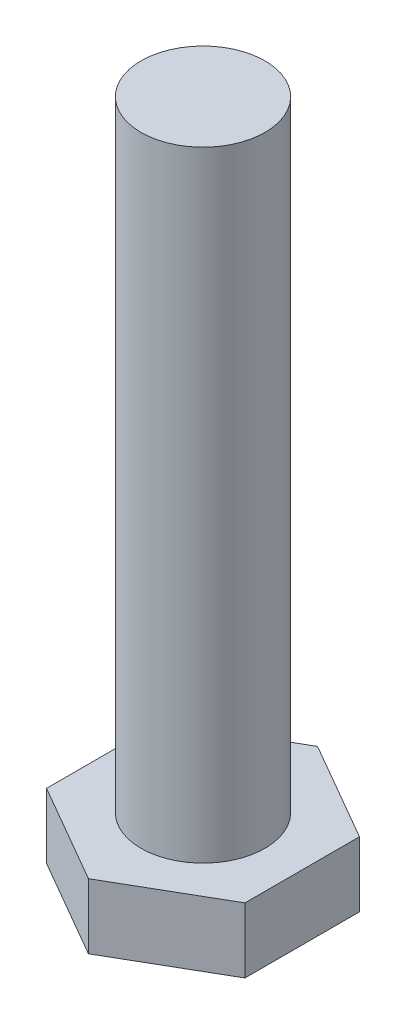
ISO-10303-21;
HEADER;
FILE_DESCRIPTION(('STEP AP214'),'2;1');
FILE_NAME('part.step','',(''),(''),'','','');
FILE_SCHEMA(('AUTOMOTIVE_DESIGN { 1 0 10303 214 1 1 1 1 }'));
ENDSEC;
DATA;
#1=APPLICATION_CONTEXT('core data for automotive mechanical design processes');
#2=APPLICATION_PROTOCOL_DEFINITION('international standard','automotive_design',2000,#1);
#3=PRODUCT_CONTEXT('',#1,'mechanical');
#4=PRODUCT('Part','Part','',(#3));
#5=PRODUCT_RELATED_PRODUCT_CATEGORY('part','',(#4));
#6=PRODUCT_DEFINITION_FORMATION('','',#4);
#7=PRODUCT_DEFINITION_CONTEXT('part definition',#1,'design');
#8=PRODUCT_DEFINITION('design','',#6,#7);
#9=PRODUCT_DEFINITION_SHAPE('','',#8);
#10=(LENGTH_UNIT() NAMED_UNIT(*) SI_UNIT(.MILLI.,.METRE.));
#11=(NAMED_UNIT(*) PLANE_ANGLE_UNIT() SI_UNIT($,.RADIAN.));
#12=(NAMED_UNIT(*) SI_UNIT($,.STERADIAN.) SOLID_ANGLE_UNIT());
#13=UNCERTAINTY_MEASURE_WITH_UNIT(LENGTH_MEASURE(1.E-05),#10,'distance_accuracy_value','');
#14=(GEOMETRIC_REPRESENTATION_CONTEXT(3) GLOBAL_UNCERTAINTY_ASSIGNED_CONTEXT((#13)) GLOBAL_UNIT_ASSIGNED_CONTEXT((#10,
#11,#12)) REPRESENTATION_CONTEXT('',''));
#15=CARTESIAN_POINT('',(0.,0.,0.));
#16=DIRECTION('',(0.,0.,1.));
#17=DIRECTION('',(1.,0.,0.));
#18=AXIS2_PLACEMENT_3D('',#15,#16,#17);
#19=CARTESIAN_POINT('',(0.,3.2,0.));
#20=DIRECTION('',(0.,1.,0.));
#21=DIRECTION('',(0.,0.,1.));
#22=AXIS2_PLACEMENT_3D('',#19,#20,#21);
#23=PLANE('',#22);
#24=DIRECTION('',(0.866025403784439,0.,-0.5));
#25=VECTOR('',#24,1.);
#26=CARTESIAN_POINT('',(0.,3.2,4.61880215351701));
#27=LINE('',#26,#25);
#28=CARTESIAN_POINT('',(0.,3.2,4.61880215351701));
#29=VERTEX_POINT('',#28);
#30=CARTESIAN_POINT('',(4.,3.2,2.3094010767585));
#31=VERTEX_POINT('',#30);
#32=EDGE_CURVE('E118',#29,#31,#27,.T.);
#33=ORIENTED_EDGE('',*,*,#32,.T.);
#34=DIRECTION('',(0.,0.,-1.));
#35=VECTOR('',#34,1.);
#36=CARTESIAN_POINT('',(4.,3.2,2.3094010767585));
#37=LINE('',#36,#35);
#38=CARTESIAN_POINT('',(4.,3.2,-2.3094010767585));
#39=VERTEX_POINT('',#38);
#40=EDGE_CURVE('E107',#31,#39,#37,.T.);
#41=ORIENTED_EDGE('',*,*,#40,.T.);
#42=DIRECTION('',(-0.866025403784439,0.,-0.5));
#43=VECTOR('',#42,1.);
#44=CARTESIAN_POINT('',(4.,3.2,-2.3094010767585));
#45=LINE('',#44,#43);
#46=CARTESIAN_POINT('',(0.,3.2,-4.61880215351701));
#47=VERTEX_POINT('',#46);
#48=EDGE_CURVE('E117',#39,#47,#45,.T.);
#49=ORIENTED_EDGE('',*,*,#48,.T.);
#50=DIRECTION('',(-0.866025403784438,0.,0.5));
#51=VECTOR('',#50,1.);
#52=CARTESIAN_POINT('',(0.,3.2,-4.61880215351701));
#53=LINE('',#52,#51);
#54=CARTESIAN_POINT('',(-4.,3.2,-2.3094010767585));
#55=VERTEX_POINT('',#54);
#56=EDGE_CURVE('E186',#47,#55,#53,.T.);
#57=ORIENTED_EDGE('',*,*,#56,.T.);
#58=DIRECTION('',(0.,0.,1.));
#59=VECTOR('',#58,1.);
#60=CARTESIAN_POINT('',(-4.,3.2,-2.3094010767585));
#61=LINE('',#60,#59);
#62=CARTESIAN_POINT('',(-4.,3.2,2.3094010767585));
#63=VERTEX_POINT('',#62);
#64=EDGE_CURVE('E188',#55,#63,#61,.T.);
#65=ORIENTED_EDGE('',*,*,#64,.T.);
#66=DIRECTION('',(0.866025403784439,0.,0.5));
#67=VECTOR('',#66,1.);
#68=CARTESIAN_POINT('',(-4.,3.2,2.3094010767585));
#69=LINE('',#68,#67);
#70=EDGE_CURVE('E123',#63,#29,#69,.T.);
#71=ORIENTED_EDGE('',*,*,#70,.T.);
#72=EDGE_LOOP('',(#33,#41,#49,#57,#65,#71));
#73=FACE_BOUND('',#72,.T.);
#74=CARTESIAN_POINT('',(0.,3.2,0.));
#75=DIRECTION('',(0.,1.,0.));
#76=DIRECTION('',(0.,0.,1.));
#77=AXIS2_PLACEMENT_3D('',#74,#75,#76);
#78=CIRCLE('',#77,2.5);
#79=CARTESIAN_POINT('',(0.,3.2,2.5));
#80=VERTEX_POINT('',#79);
#81=EDGE_CURVE('E174',#80,#80,#78,.T.);
#82=ORIENTED_EDGE('',*,*,#81,.F.);
#83=EDGE_LOOP('',(#82));
#84=FACE_BOUND('',#83,.T.);
#85=ADVANCED_FACE('F34',(#73,#84),#23,.T.);
#86=CARTESIAN_POINT('',(0.,3.2,4.61880215351701));
#87=DIRECTION('',(-0.5,0.,-0.866025403784439));
#88=DIRECTION('',(-0.866025403784439,0.,0.5));
#89=AXIS2_PLACEMENT_3D('',#86,#87,#88);
#90=PLANE('',#89);
#91=DIRECTION('',(0.,-1.,0.));
#92=VECTOR('',#91,1.);
#93=CARTESIAN_POINT('',(0.,3.2,4.61880215351701));
#94=LINE('',#93,#92);
#95=CARTESIAN_POINT('',(0.,0.577350269189627,4.61880215351701));
#96=VERTEX_POINT('',#95);
#97=EDGE_CURVE('E191',#29,#96,#94,.T.);
#98=ORIENTED_EDGE('',*,*,#97,.T.);
#99=DIRECTION('',(0.866025403784439,0.,-0.5));
#100=VECTOR('',#99,1.);
#101=CARTESIAN_POINT('',(0.,0.577350269189626,4.61880215351701));
#102=LINE('',#101,#100);
#103=CARTESIAN_POINT('',(4.,0.577350269189626,2.3094010767585));
#104=VERTEX_POINT('',#103);
#105=EDGE_CURVE('E131',#96,#104,#102,.T.);
#106=ORIENTED_EDGE('',*,*,#105,.T.);
#107=DIRECTION('',(0.,-1.,0.));
#108=VECTOR('',#107,1.);
#109=CARTESIAN_POINT('',(4.,3.2,2.3094010767585));
#110=LINE('',#109,#108);
#111=EDGE_CURVE('E111',#31,#104,#110,.T.);
#112=ORIENTED_EDGE('',*,*,#111,.F.);
#113=ORIENTED_EDGE('',*,*,#32,.F.);
#114=EDGE_LOOP('',(#98,#106,#112,#113));
#115=FACE_BOUND('',#114,.T.);
#116=ADVANCED_FACE('F129',(#115),#90,.F.);
#117=CARTESIAN_POINT('',(4.,3.2,2.3094010767585));
#118=DIRECTION('',(-1.,0.,0.));
#119=DIRECTION('',(0.,0.,1.));
#120=AXIS2_PLACEMENT_3D('',#117,#118,#119);
#121=PLANE('',#120);
#122=ORIENTED_EDGE('',*,*,#111,.T.);
#123=DIRECTION('',(0.,0.,-1.));
#124=VECTOR('',#123,1.);
#125=CARTESIAN_POINT('',(4.,0.577350269189626,2.3094010767585));
#126=LINE('',#125,#124);
#127=CARTESIAN_POINT('',(4.,0.577350269189626,-2.3094010767585));
#128=VERTEX_POINT('',#127);
#129=EDGE_CURVE('E153',#104,#128,#126,.T.);
#130=ORIENTED_EDGE('',*,*,#129,.T.);
#131=DIRECTION('',(0.,-1.,0.));
#132=VECTOR('',#131,1.);
#133=CARTESIAN_POINT('',(4.,3.2,-2.3094010767585));
#134=LINE('',#133,#132);
#135=EDGE_CURVE('E114',#39,#128,#134,.T.);
#136=ORIENTED_EDGE('',*,*,#135,.F.);
#137=ORIENTED_EDGE('',*,*,#40,.F.);
#138=EDGE_LOOP('',(#122,#130,#136,#137));
#139=FACE_BOUND('',#138,.T.);
#140=ADVANCED_FACE('F109',(#139),#121,.F.);
#141=CARTESIAN_POINT('',(4.,3.2,-2.3094010767585));
#142=DIRECTION('',(-0.5,0.,0.866025403784439));
#143=DIRECTION('',(0.866025403784439,0.,0.5));
#144=AXIS2_PLACEMENT_3D('',#141,#142,#143);
#145=PLANE('',#144);
#146=ORIENTED_EDGE('',*,*,#135,.T.);
#147=DIRECTION('',(-0.866025403784439,0.,-0.5));
#148=VECTOR('',#147,1.);
#149=CARTESIAN_POINT('',(4.,0.577350269189626,-2.3094010767585));
#150=LINE('',#149,#148);
#151=CARTESIAN_POINT('',(0.,0.577350269189626,-4.61880215351701));
#152=VERTEX_POINT('',#151);
#153=EDGE_CURVE('E132',#128,#152,#150,.T.);
#154=ORIENTED_EDGE('',*,*,#153,.T.);
#155=DIRECTION('',(0.,-1.,0.));
#156=VECTOR('',#155,1.);
#157=CARTESIAN_POINT('',(0.,3.2,-4.61880215351701));
#158=LINE('',#157,#156);
#159=EDGE_CURVE('E137',#47,#152,#158,.T.);
#160=ORIENTED_EDGE('',*,*,#159,.F.);
#161=ORIENTED_EDGE('',*,*,#48,.F.);
#162=EDGE_LOOP('',(#146,#154,#160,#161));
#163=FACE_BOUND('',#162,.T.);
#164=ADVANCED_FACE('F200',(#163),#145,.F.);
#165=CARTESIAN_POINT('',(0.,3.2,-4.61880215351701));
#166=DIRECTION('',(0.5,0.,0.866025403784438));
#167=DIRECTION('',(0.866025403784439,0.,-0.5));
#168=AXIS2_PLACEMENT_3D('',#165,#166,#167);
#169=PLANE('',#168);
#170=ORIENTED_EDGE('',*,*,#159,.T.);
#171=DIRECTION('',(-0.866025403784439,0.,0.5));
#172=VECTOR('',#171,1.);
#173=CARTESIAN_POINT('',(0.,0.577350269189626,-4.61880215351701));
#174=LINE('',#173,#172);
#175=CARTESIAN_POINT('',(-4.,0.577350269189626,-2.3094010767585));
#176=VERTEX_POINT('',#175);
#177=EDGE_CURVE('E11',#152,#176,#174,.T.);
#178=ORIENTED_EDGE('',*,*,#177,.T.);
#179=DIRECTION('',(0.,-1.,0.));
#180=VECTOR('',#179,1.);
#181=CARTESIAN_POINT('',(-4.,3.2,-2.3094010767585));
#182=LINE('',#181,#180);
#183=EDGE_CURVE('E195',#55,#176,#182,.T.);
#184=ORIENTED_EDGE('',*,*,#183,.F.);
#185=ORIENTED_EDGE('',*,*,#56,.F.);
#186=EDGE_LOOP('',(#170,#178,#184,#185));
#187=FACE_BOUND('',#186,.T.);
#188=ADVANCED_FACE('F198',(#187),#169,.F.);
#189=CARTESIAN_POINT('',(-4.,3.2,-2.3094010767585));
#190=DIRECTION('',(1.,0.,0.));
#191=DIRECTION('',(0.,0.,-1.));
#192=AXIS2_PLACEMENT_3D('',#189,#190,#191);
#193=PLANE('',#192);
#194=ORIENTED_EDGE('',*,*,#183,.T.);
#195=DIRECTION('',(0.,0.,1.));
#196=VECTOR('',#195,1.);
#197=CARTESIAN_POINT('',(-4.,0.577350269189626,-2.3094010767585));
#198=LINE('',#197,#196);
#199=CARTESIAN_POINT('',(-4.,0.577350269189626,2.3094010767585));
#200=VERTEX_POINT('',#199);
#201=EDGE_CURVE('E43',#176,#200,#198,.T.);
#202=ORIENTED_EDGE('',*,*,#201,.T.);
#203=DIRECTION('',(0.,-1.,0.));
#204=VECTOR('',#203,1.);
#205=CARTESIAN_POINT('',(-4.,3.2,2.3094010767585));
#206=LINE('',#205,#204);
#207=EDGE_CURVE('E193',#63,#200,#206,.T.);
#208=ORIENTED_EDGE('',*,*,#207,.F.);
#209=ORIENTED_EDGE('',*,*,#64,.F.);
#210=EDGE_LOOP('',(#194,#202,#208,#209));
#211=FACE_BOUND('',#210,.T.);
#212=ADVANCED_FACE('F221',(#211),#193,.F.);
#213=CARTESIAN_POINT('',(-4.,3.2,2.3094010767585));
#214=DIRECTION('',(0.5,0.,-0.866025403784439));
#215=DIRECTION('',(-0.866025403784439,0.,-0.5));
#216=AXIS2_PLACEMENT_3D('',#213,#214,#215);
#217=PLANE('',#216);
#218=ORIENTED_EDGE('',*,*,#207,.T.);
#219=DIRECTION('',(0.866025403784439,0.,0.5));
#220=VECTOR('',#219,1.);
#221=CARTESIAN_POINT('',(-4.,0.577350269189627,2.3094010767585));
#222=LINE('',#221,#220);
#223=EDGE_CURVE('E156',#200,#96,#222,.T.);
#224=ORIENTED_EDGE('',*,*,#223,.T.);
#225=ORIENTED_EDGE('',*,*,#97,.F.);
#226=ORIENTED_EDGE('',*,*,#70,.F.);
#227=EDGE_LOOP('',(#218,#224,#225,#226));
#228=FACE_BOUND('',#227,.T.);
#229=ADVANCED_FACE('F219',(#228),#217,.F.);
#230=CARTESIAN_POINT('',(0.,0.,0.));
#231=DIRECTION('',(0.,1.,0.));
#232=DIRECTION('',(0.,0.,1.));
#233=AXIS2_PLACEMENT_3D('',#230,#231,#232);
#234=PLANE('',#233);
#235=DIRECTION('',(0.866025403784439,0.,-0.5));
#236=VECTOR('',#235,1.);
#237=CARTESIAN_POINT('',(-1.5,0.,-2.59807621135331));
#238=LINE('',#237,#236);
#239=CARTESIAN_POINT('',(-3.,0.,-1.73205080756887));
#240=VERTEX_POINT('',#239);
#241=CARTESIAN_POINT('',(0.,0.,-3.46410161513775));
#242=VERTEX_POINT('',#241);
#243=EDGE_CURVE('E135',#240,#242,#238,.T.);
#244=ORIENTED_EDGE('',*,*,#243,.T.);
#245=DIRECTION('',(0.866025403784439,0.,0.5));
#246=VECTOR('',#245,1.);
#247=CARTESIAN_POINT('',(1.5,0.,-2.59807621135331));
#248=LINE('',#247,#246);
#249=CARTESIAN_POINT('',(2.99999999999999,0.,-1.73205080756887));
#250=VERTEX_POINT('',#249);
#251=EDGE_CURVE('E150',#242,#250,#248,.T.);
#252=ORIENTED_EDGE('',*,*,#251,.T.);
#253=DIRECTION('',(0.,0.,1.));
#254=VECTOR('',#253,1.);
#255=CARTESIAN_POINT('',(3.,0.,0.));
#256=LINE('',#255,#254);
#257=CARTESIAN_POINT('',(3.,0.,1.73205080756887));
#258=VERTEX_POINT('',#257);
#259=EDGE_CURVE('E148',#250,#258,#256,.T.);
#260=ORIENTED_EDGE('',*,*,#259,.T.);
#261=DIRECTION('',(-0.866025403784439,0.,0.5));
#262=VECTOR('',#261,1.);
#263=CARTESIAN_POINT('',(1.5,0.,2.59807621135331));
#264=LINE('',#263,#262);
#265=CARTESIAN_POINT('',(0.,0.,3.46410161513775));
#266=VERTEX_POINT('',#265);
#267=EDGE_CURVE('E146',#258,#266,#264,.T.);
#268=ORIENTED_EDGE('',*,*,#267,.T.);
#269=DIRECTION('',(-0.866025403784439,0.,-0.5));
#270=VECTOR('',#269,1.);
#271=CARTESIAN_POINT('',(-1.5,0.,2.59807621135331));
#272=LINE('',#271,#270);
#273=CARTESIAN_POINT('',(-3.,0.,1.73205080756887));
#274=VERTEX_POINT('',#273);
#275=EDGE_CURVE('E144',#266,#274,#272,.T.);
#276=ORIENTED_EDGE('',*,*,#275,.T.);
#277=DIRECTION('',(0.,0.,-1.));
#278=VECTOR('',#277,1.);
#279=CARTESIAN_POINT('',(-3.,0.,0.));
#280=LINE('',#279,#278);
#281=EDGE_CURVE('E142',#274,#240,#280,.T.);
#282=ORIENTED_EDGE('',*,*,#281,.T.);
#283=EDGE_LOOP('',(#244,#252,#260,#268,#276,#282));
#284=FACE_BOUND('',#283,.T.);
#285=ADVANCED_FACE('F214',(#284),#234,.F.);
#286=CARTESIAN_POINT('',(0.,28.2,0.));
#287=DIRECTION('',(0.,-1.,0.));
#288=DIRECTION('',(0.,0.,-1.));
#289=AXIS2_PLACEMENT_3D('',#286,#287,#288);
#290=CYLINDRICAL_SURFACE('',#289,2.5);
#291=CARTESIAN_POINT('',(0.,28.2,0.));
#292=DIRECTION('',(0.,1.,0.));
#293=DIRECTION('',(0.,0.,1.));
#294=AXIS2_PLACEMENT_3D('',#291,#292,#293);
#295=CIRCLE('',#294,2.5);
#296=CARTESIAN_POINT('',(0.,28.2,2.5));
#297=VERTEX_POINT('',#296);
#298=EDGE_CURVE('E127',#297,#297,#295,.T.);
#299=ORIENTED_EDGE('',*,*,#298,.F.);
#300=EDGE_LOOP('',(#299));
#301=FACE_BOUND('',#300,.T.);
#302=ORIENTED_EDGE('',*,*,#81,.T.);
#303=EDGE_LOOP('',(#302));
#304=FACE_BOUND('',#303,.T.);
#305=ADVANCED_FACE('F238',(#301,#304),#290,.T.);
#306=CARTESIAN_POINT('',(0.,28.2,0.));
#307=DIRECTION('',(0.,1.,0.));
#308=DIRECTION('',(0.,0.,1.));
#309=AXIS2_PLACEMENT_3D('',#306,#307,#308);
#310=PLANE('',#309);
#311=ORIENTED_EDGE('',*,*,#298,.T.);
#312=EDGE_LOOP('',(#311));
#313=FACE_BOUND('',#312,.T.);
#314=ADVANCED_FACE('F244',(#313),#310,.T.);
#315=CARTESIAN_POINT('',(-4.,0.577350269189626,2.3094010767585));
#316=DIRECTION('',(0.249999999999999,0.866025403784439,-0.433012701892218));
#317=DIRECTION('',(0.866025403784439,0.,0.5));
#318=AXIS2_PLACEMENT_3D('',#315,#316,#317);
#319=PLANE('',#318);
#320=DIRECTION('',(-0.774596669241484,0.447213595499957,0.447213595499959));
#321=VECTOR('',#320,1.);
#322=CARTESIAN_POINT('',(-2.4,-0.346410161513774,1.3856406460551));
#323=LINE('',#322,#321);
#324=EDGE_CURVE('E168',#274,#200,#323,.T.);
#325=ORIENTED_EDGE('',*,*,#324,.F.);
#326=ORIENTED_EDGE('',*,*,#275,.F.);
#327=DIRECTION('',(0.,0.447213595499956,0.894427190999917));
#328=VECTOR('',#327,1.);
#329=CARTESIAN_POINT('',(0.,-0.346410161513774,2.7712812921102));
#330=LINE('',#329,#328);
#331=EDGE_CURVE('E38',#96,#266,#330,.F.);
#332=ORIENTED_EDGE('',*,*,#331,.F.);
#333=ORIENTED_EDGE('',*,*,#223,.F.);
#334=EDGE_LOOP('',(#325,#326,#332,#333));
#335=FACE_BOUND('',#334,.T.);
#336=ADVANCED_FACE('F36',(#335),#319,.F.);
#337=CARTESIAN_POINT('',(0.,0.577350269189626,4.61880215351701));
#338=DIRECTION('',(-0.249999999999999,0.86602540378444,-0.433012701892218));
#339=DIRECTION('',(0.866025403784439,0.,-0.5));
#340=AXIS2_PLACEMENT_3D('',#337,#338,#339);
#341=PLANE('',#340);
#342=ORIENTED_EDGE('',*,*,#331,.T.);
#343=ORIENTED_EDGE('',*,*,#267,.F.);
#344=DIRECTION('',(0.774596669241484,0.447213595499956,0.447213595499959));
#345=VECTOR('',#344,1.);
#346=CARTESIAN_POINT('',(2.4,-0.346410161513773,1.3856406460551));
#347=LINE('',#346,#345);
#348=EDGE_CURVE('E166',#104,#258,#347,.F.);
#349=ORIENTED_EDGE('',*,*,#348,.F.);
#350=ORIENTED_EDGE('',*,*,#105,.F.);
#351=EDGE_LOOP('',(#342,#343,#349,#350));
#352=FACE_BOUND('',#351,.T.);
#353=ADVANCED_FACE('F254',(#352),#341,.F.);
#354=CARTESIAN_POINT('',(-4.,0.577350269189626,-2.3094010767585));
#355=DIRECTION('',(0.499999999999999,0.866025403784439,0.));
#356=DIRECTION('',(0.,0.,1.));
#357=AXIS2_PLACEMENT_3D('',#354,#355,#356);
#358=PLANE('',#357);
#359=ORIENTED_EDGE('',*,*,#324,.T.);
#360=ORIENTED_EDGE('',*,*,#201,.F.);
#361=DIRECTION('',(-0.774596669241484,0.447213595499957,-0.447213595499959));
#362=VECTOR('',#361,1.);
#363=CARTESIAN_POINT('',(-2.4,-0.346410161513772,-1.3856406460551));
#364=LINE('',#363,#362);
#365=EDGE_CURVE('E163',#240,#176,#364,.T.);
#366=ORIENTED_EDGE('',*,*,#365,.F.);
#367=ORIENTED_EDGE('',*,*,#281,.F.);
#368=EDGE_LOOP('',(#359,#360,#366,#367));
#369=FACE_BOUND('',#368,.T.);
#370=ADVANCED_FACE('F212',(#369),#358,.F.);
#371=CARTESIAN_POINT('',(4.,0.577350269189626,2.3094010767585));
#372=DIRECTION('',(-0.499999999999998,0.866025403784439,0.));
#373=DIRECTION('',(0.,0.,-1.));
#374=AXIS2_PLACEMENT_3D('',#371,#372,#373);
#375=PLANE('',#374);
#376=ORIENTED_EDGE('',*,*,#348,.T.);
#377=ORIENTED_EDGE('',*,*,#259,.F.);
#378=DIRECTION('',(0.774596669241484,0.447213595499957,-0.447213595499958));
#379=VECTOR('',#378,1.);
#380=CARTESIAN_POINT('',(2.4,-0.346410161513772,-1.3856406460551));
#381=LINE('',#380,#379);
#382=EDGE_CURVE('E161',#128,#250,#381,.F.);
#383=ORIENTED_EDGE('',*,*,#382,.F.);
#384=ORIENTED_EDGE('',*,*,#129,.F.);
#385=EDGE_LOOP('',(#376,#377,#383,#384));
#386=FACE_BOUND('',#385,.T.);
#387=ADVANCED_FACE('F261',(#386),#375,.F.);
#388=CARTESIAN_POINT('',(0.,0.577350269189626,-4.61880215351701));
#389=DIRECTION('',(0.249999999999999,0.866025403784439,0.433012701892218));
#390=DIRECTION('',(-0.866025403784439,0.,0.5));
#391=AXIS2_PLACEMENT_3D('',#388,#389,#390);
#392=PLANE('',#391);
#393=ORIENTED_EDGE('',*,*,#365,.T.);
#394=ORIENTED_EDGE('',*,*,#177,.F.);
#395=DIRECTION('',(0.,-0.447213595499957,0.894427190999917));
#396=VECTOR('',#395,1.);
#397=CARTESIAN_POINT('',(0.,0.577350269189626,-4.61880215351701));
#398=LINE('',#397,#396);
#399=EDGE_CURVE('E159',#242,#152,#398,.F.);
#400=ORIENTED_EDGE('',*,*,#399,.F.);
#401=ORIENTED_EDGE('',*,*,#243,.F.);
#402=EDGE_LOOP('',(#393,#394,#400,#401));
#403=FACE_BOUND('',#402,.T.);
#404=ADVANCED_FACE('F210',(#403),#392,.F.);
#405=CARTESIAN_POINT('',(4.,0.577350269189626,-2.3094010767585));
#406=DIRECTION('',(-0.249999999999999,0.866025403784439,0.433012701892218));
#407=DIRECTION('',(-0.866025403784439,0.,-0.5));
#408=AXIS2_PLACEMENT_3D('',#405,#406,#407);
#409=PLANE('',#408);
#410=ORIENTED_EDGE('',*,*,#382,.T.);
#411=ORIENTED_EDGE('',*,*,#251,.F.);
#412=ORIENTED_EDGE('',*,*,#399,.T.);
#413=ORIENTED_EDGE('',*,*,#153,.F.);
#414=EDGE_LOOP('',(#410,#411,#412,#413));
#415=FACE_BOUND('',#414,.T.);
#416=ADVANCED_FACE('F204',(#415),#409,.F.);
#417=CLOSED_SHELL('',(#85,#116,#140,#164,#188,#212,#229,#285,#305,#314,#336,#353,#370,#387,#404,#416));
#418=MANIFOLD_SOLID_BREP('B2',#417);
#419=ADVANCED_BREP_SHAPE_REPRESENTATION('',(#18,#418),#14);
#420=SHAPE_DEFINITION_REPRESENTATION(#9,#419);
ENDSEC;
END-ISO-10303-21;
